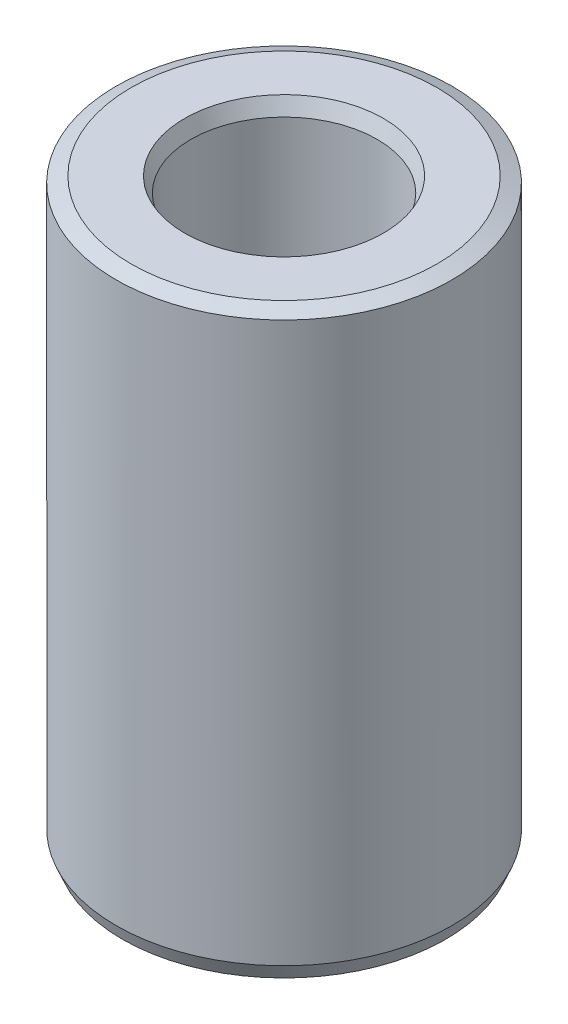
ISO-10303-21;
HEADER;
FILE_DESCRIPTION(('STEP AP214'),'2;1');
FILE_NAME('part.step','',(''),(''),'','','');
FILE_SCHEMA(('AUTOMOTIVE_DESIGN { 1 0 10303 214 1 1 1 1 }'));
ENDSEC;
DATA;
#1=APPLICATION_CONTEXT('core data for automotive mechanical design processes');
#2=APPLICATION_PROTOCOL_DEFINITION('international standard','automotive_design',2000,#1);
#3=PRODUCT_CONTEXT('',#1,'mechanical');
#4=PRODUCT('Part','Part','',(#3));
#5=PRODUCT_RELATED_PRODUCT_CATEGORY('part','',(#4));
#6=PRODUCT_DEFINITION_FORMATION('','',#4);
#7=PRODUCT_DEFINITION_CONTEXT('part definition',#1,'design');
#8=PRODUCT_DEFINITION('design','',#6,#7);
#9=PRODUCT_DEFINITION_SHAPE('','',#8);
#10=(LENGTH_UNIT() NAMED_UNIT(*) SI_UNIT(.MILLI.,.METRE.));
#11=(NAMED_UNIT(*) PLANE_ANGLE_UNIT() SI_UNIT($,.RADIAN.));
#12=(NAMED_UNIT(*) SI_UNIT($,.STERADIAN.) SOLID_ANGLE_UNIT());
#13=UNCERTAINTY_MEASURE_WITH_UNIT(LENGTH_MEASURE(1.E-05),#10,'distance_accuracy_value','');
#14=(GEOMETRIC_REPRESENTATION_CONTEXT(3) GLOBAL_UNCERTAINTY_ASSIGNED_CONTEXT((#13)) GLOBAL_UNIT_ASSIGNED_CONTEXT((#10,
#11,#12)) REPRESENTATION_CONTEXT('',''));
#15=CARTESIAN_POINT('',(0.,0.,0.));
#16=DIRECTION('',(0.,0.,1.));
#17=DIRECTION('',(1.,0.,0.));
#18=AXIS2_PLACEMENT_3D('',#15,#16,#17);
#19=CARTESIAN_POINT('',(0.,181.538281367582,0.));
#20=DIRECTION('',(0.,-1.,0.));
#21=DIRECTION('',(0.,0.,-1.));
#22=AXIS2_PLACEMENT_3D('',#19,#20,#21);
#23=CYLINDRICAL_SURFACE('',#22,52.5);
#24=CARTESIAN_POINT('',(0.,4.69443554910651,0.));
#25=DIRECTION('',(0.,1.,0.));
#26=DIRECTION('',(0.,0.,1.));
#27=AXIS2_PLACEMENT_3D('',#24,#25,#26);
#28=CIRCLE('',#27,52.5);
#29=CARTESIAN_POINT('',(0.,4.69443554910648,-52.5));
#30=VERTEX_POINT('',#29);
#31=EDGE_CURVE('E10',#30,#30,#28,.T.);
#32=CARTESIAN_POINT('',(0.,179.58006216952,0.));
#33=DIRECTION('',(0.,1.,0.));
#34=DIRECTION('',(0.,0.,1.));
#35=AXIS2_PLACEMENT_3D('',#32,#33,#34);
#36=CIRCLE('',#35,52.5);
#37=CARTESIAN_POINT('',(0.,179.58006216952,-52.5));
#38=VERTEX_POINT('',#37);
#39=EDGE_CURVE('E50',#38,#38,#36,.F.);
#40=CARTESIAN_POINT('',(0.,4.69443554910648,-52.5));
#41=CARTESIAN_POINT('',(0.,6.51616082640246,-52.5));
#42=CARTESIAN_POINT('',(0.,8.33788610369844,-52.5));
#43=CARTESIAN_POINT('',(0.,11.9813366582904,-52.5));
#44=CARTESIAN_POINT('',(0.,13.8030619355864,-52.5));
#45=CARTESIAN_POINT('',(0.,17.4465124901783,-52.5));
#46=CARTESIAN_POINT('',(0.,19.2682377674743,-52.5));
#47=CARTESIAN_POINT('',(0.,22.9116883220662,-52.5));
#48=CARTESIAN_POINT('',(0.,24.7334135993622,-52.5));
#49=CARTESIAN_POINT('',(0.,28.3768641539542,-52.5));
#50=CARTESIAN_POINT('',(0.,30.1985894312501,-52.5));
#51=CARTESIAN_POINT('',(0.,33.8420399858421,-52.5));
#52=CARTESIAN_POINT('',(0.,35.6637652631381,-52.5));
#53=CARTESIAN_POINT('',(0.,39.30721581773,-52.5));
#54=CARTESIAN_POINT('',(0.,41.128941095026,-52.5));
#55=CARTESIAN_POINT('',(0.,44.772391649618,-52.5));
#56=CARTESIAN_POINT('',(0.,46.5941169269139,-52.5));
#57=CARTESIAN_POINT('',(0.,50.2375674815059,-52.5));
#58=CARTESIAN_POINT('',(0.,52.0592927588019,-52.5));
#59=CARTESIAN_POINT('',(0.,55.7027433133938,-52.5));
#60=CARTESIAN_POINT('',(0.,57.5244685906898,-52.5));
#61=CARTESIAN_POINT('',(0.,61.1679191452817,-52.5));
#62=CARTESIAN_POINT('',(0.,62.9896444225777,-52.5));
#63=CARTESIAN_POINT('',(0.,66.6330949771696,-52.5));
#64=CARTESIAN_POINT('',(0.,68.4548202544656,-52.5));
#65=CARTESIAN_POINT('',(0.,72.0982708090576,-52.5));
#66=CARTESIAN_POINT('',(0.,73.9199960863535,-52.5));
#67=CARTESIAN_POINT('',(0.,77.5634466409455,-52.5));
#68=CARTESIAN_POINT('',(0.,79.3851719182415,-52.5));
#69=CARTESIAN_POINT('',(0.,83.0286224728334,-52.5));
#70=CARTESIAN_POINT('',(0.,84.8503477501294,-52.5));
#71=CARTESIAN_POINT('',(0.,88.4937983047214,-52.5));
#72=CARTESIAN_POINT('',(0.,90.3155235820173,-52.5));
#73=CARTESIAN_POINT('',(0.,93.9589741366093,-52.5));
#74=CARTESIAN_POINT('',(0.,95.7806994139053,-52.5));
#75=CARTESIAN_POINT('',(0.,99.4241499684972,-52.5));
#76=CARTESIAN_POINT('',(0.,101.245875245793,-52.5));
#77=CARTESIAN_POINT('',(0.,104.889325800385,-52.5));
#78=CARTESIAN_POINT('',(0.,106.711051077681,-52.5));
#79=CARTESIAN_POINT('',(0.,110.354501632273,-52.5));
#80=CARTESIAN_POINT('',(0.,112.176226909569,-52.5));
#81=CARTESIAN_POINT('',(0.,115.819677464161,-52.5));
#82=CARTESIAN_POINT('',(0.,117.641402741457,-52.5));
#83=CARTESIAN_POINT('',(0.,121.284853296049,-52.5));
#84=CARTESIAN_POINT('',(0.,123.106578573345,-52.5));
#85=CARTESIAN_POINT('',(0.,126.750029127937,-52.5));
#86=CARTESIAN_POINT('',(0.,128.571754405233,-52.5));
#87=CARTESIAN_POINT('',(0.,132.215204959825,-52.5));
#88=CARTESIAN_POINT('',(0.,134.036930237121,-52.5));
#89=CARTESIAN_POINT('',(0.,137.680380791713,-52.5));
#90=CARTESIAN_POINT('',(0.,139.502106069009,-52.5));
#91=CARTESIAN_POINT('',(0.,143.145556623601,-52.5));
#92=CARTESIAN_POINT('',(0.,144.967281900897,-52.5));
#93=CARTESIAN_POINT('',(0.,148.610732455489,-52.5));
#94=CARTESIAN_POINT('',(0.,150.432457732785,-52.5));
#95=CARTESIAN_POINT('',(0.,154.075908287376,-52.5));
#96=CARTESIAN_POINT('',(0.,155.897633564672,-52.5));
#97=CARTESIAN_POINT('',(0.,159.541084119264,-52.5));
#98=CARTESIAN_POINT('',(0.,161.36280939656,-52.5));
#99=CARTESIAN_POINT('',(0.,165.006259951152,-52.5));
#100=CARTESIAN_POINT('',(0.,166.827985228448,-52.5));
#101=CARTESIAN_POINT('',(0.,170.47143578304,-52.5));
#102=CARTESIAN_POINT('',(0.,172.293161060336,-52.5));
#103=CARTESIAN_POINT('',(0.,175.936611614928,-52.5));
#104=CARTESIAN_POINT('',(0.,177.758336892224,-52.5));
#105=CARTESIAN_POINT('',(0.,179.58006216952,-52.5));
#106=B_SPLINE_CURVE_WITH_KNOTS('',3,(#40,#41,#42,#43,#44,#45,#46,#47,#48,#49,#50,#51,#52,#53,
#54,#55,#56,#57,#58,#59,#60,#61,#62,#63,#64,#65,#66,#67,#68,#69,#70,#71,#72,#73,#74,#75,#76,#77,
#78,#79,#80,#81,#82,#83,#84,#85,#86,#87,#88,#89,#90,#91,#92,#93,#94,#95,#96,#97,#98,#99,#100,
#101,#102,#103,#104,#105),.UNSPECIFIED.,.F.,.F.,(4,2,2,2,2,2,2,2,2,2,2,2,2,2,2,2,2,2,2,2,2,2,2,
2,2,2,2,2,2,2,2,2,4),(0.,5.46517583188794,10.9303516637758,16.3955274956638,21.8607033275517,
27.3258791594396,32.7910549913276,38.2562308232155,43.7214066551034,49.1865824869913,
54.6517583188793,60.1169341507672,65.5821099826551,71.047285814543,76.512461646431,
81.9776374783189,87.4428133102068,92.9079891420947,98.3731649739827,103.838340805871,
109.303516637759,114.768692469646,120.233868301534,125.699044133422,131.16421996531,
136.629395797198,142.094571629086,147.559747460974,153.024923292862,158.49009912475,
163.955274956638,169.420450788526,174.885626620414),.UNSPECIFIED.);
#107=EDGE_CURVE('BSEAM39',#30,#38,#106,.T.);
#108=ORIENTED_EDGE('',*,*,#31,.T.);
#109=ORIENTED_EDGE('',*,*,#39,.T.);
#110=ORIENTED_EDGE('',*,*,#107,.T.);
#111=ORIENTED_EDGE('',*,*,#107,.F.);
#112=EDGE_LOOP('',(#108,#110,#109,#111));
#113=FACE_BOUND('',#112,.T.);
#114=ADVANCED_FACE('F39',(#113),#23,.T.);
#115=CARTESIAN_POINT('',(0.,181.538281367582,0.));
#116=DIRECTION('',(0.,1.,0.));
#117=DIRECTION('',(0.,0.,1.));
#118=AXIS2_PLACEMENT_3D('',#115,#116,#117);
#119=PLANE('',#118);
#120=CARTESIAN_POINT('',(0.,181.538281367582,0.));
#121=DIRECTION('',(0.,1.,0.));
#122=DIRECTION('',(0.,0.,1.));
#123=AXIS2_PLACEMENT_3D('',#120,#121,#122);
#124=CIRCLE('',#123,31.0921849153804);
#125=CARTESIAN_POINT('',(0.,181.538281367582,31.0921849153804));
#126=VERTEX_POINT('',#125);
#127=EDGE_CURVE('E58',#126,#126,#124,.F.);
#128=ORIENTED_EDGE('',*,*,#127,.T.);
#129=EDGE_LOOP('',(#128));
#130=FACE_BOUND('',#129,.T.);
#131=CARTESIAN_POINT('',(0.,181.538281367582,0.));
#132=DIRECTION('',(0.,1.,0.));
#133=DIRECTION('',(0.,0.,1.));
#134=AXIS2_PLACEMENT_3D('',#131,#132,#133);
#135=CIRCLE('',#134,47.8055644508945);
#136=CARTESIAN_POINT('',(0.,181.538281367582,47.8055644508945));
#137=VERTEX_POINT('',#136);
#138=EDGE_CURVE('E61',#137,#137,#135,.T.);
#139=ORIENTED_EDGE('',*,*,#138,.T.);
#140=EDGE_LOOP('',(#139));
#141=FACE_BOUND('',#140,.T.);
#142=ADVANCED_FACE('F88',(#130,#141),#119,.T.);
#143=CARTESIAN_POINT('',(0.,0.,0.));
#144=DIRECTION('',(0.,1.,0.));
#145=DIRECTION('',(0.,0.,1.));
#146=AXIS2_PLACEMENT_3D('',#143,#144,#145);
#147=PLANE('',#146);
#148=CARTESIAN_POINT('',(0.,0.,0.));
#149=DIRECTION('',(0.,1.,0.));
#150=DIRECTION('',(0.,0.,1.));
#151=AXIS2_PLACEMENT_3D('',#148,#149,#150);
#152=CIRCLE('',#151,33.8284012664237);
#153=CARTESIAN_POINT('',(0.,0.,33.8284012664237));
#154=VERTEX_POINT('',#153);
#155=EDGE_CURVE('E51',#154,#154,#152,.T.);
#156=ORIENTED_EDGE('',*,*,#155,.T.);
#157=EDGE_LOOP('',(#156));
#158=FACE_BOUND('',#157,.T.);
#159=CARTESIAN_POINT('',(0.,0.,0.));
#160=DIRECTION('',(0.,1.,0.));
#161=DIRECTION('',(0.,0.,1.));
#162=AXIS2_PLACEMENT_3D('',#159,#160,#161);
#163=CIRCLE('',#162,50.5417808019375);
#164=CARTESIAN_POINT('',(0.,0.,50.5417808019375));
#165=VERTEX_POINT('',#164);
#166=EDGE_CURVE('E54',#165,#165,#163,.F.);
#167=ORIENTED_EDGE('',*,*,#166,.T.);
#168=EDGE_LOOP('',(#167));
#169=FACE_BOUND('',#168,.T.);
#170=ADVANCED_FACE('F83',(#158,#169),#147,.F.);
#171=CARTESIAN_POINT('',(0.,181.538281367582,0.));
#172=DIRECTION('',(0.,-1.,0.));
#173=DIRECTION('',(0.,0.,-1.));
#174=AXIS2_PLACEMENT_3D('',#171,#172,#173);
#175=CYLINDRICAL_SURFACE('',#174,29.1339657173181);
#176=CARTESIAN_POINT('',(0.,176.843845818476,0.));
#177=DIRECTION('',(0.,1.,0.));
#178=DIRECTION('',(0.,0.,1.));
#179=AXIS2_PLACEMENT_3D('',#176,#177,#178);
#180=CIRCLE('',#179,29.1339657173181);
#181=CARTESIAN_POINT('',(0.,176.843845818476,-29.1339657173181));
#182=VERTEX_POINT('',#181);
#183=EDGE_CURVE('E67',#182,#182,#180,.T.);
#184=CARTESIAN_POINT('',(0.,1.95821919806208,0.));
#185=DIRECTION('',(0.,1.,0.));
#186=DIRECTION('',(0.,0.,1.));
#187=AXIS2_PLACEMENT_3D('',#184,#185,#186);
#188=CIRCLE('',#187,29.1339657173181);
#189=CARTESIAN_POINT('',(0.,1.95821919806205,-29.1339657173181));
#190=VERTEX_POINT('',#189);
#191=EDGE_CURVE('E69',#190,#190,#188,.F.);
#192=CARTESIAN_POINT('',(0.,176.843845818476,-29.1339657173181));
#193=CARTESIAN_POINT('',(0.,175.02212054118,-29.1339657173181));
#194=CARTESIAN_POINT('',(0.,173.200395263884,-29.1339657173181));
#195=CARTESIAN_POINT('',(0.,169.556944709292,-29.1339657173181));
#196=CARTESIAN_POINT('',(0.,167.735219431996,-29.1339657173181));
#197=CARTESIAN_POINT('',(0.,164.091768877404,-29.1339657173181));
#198=CARTESIAN_POINT('',(0.,162.270043600108,-29.1339657173181));
#199=CARTESIAN_POINT('',(0.,158.626593045516,-29.1339657173181));
#200=CARTESIAN_POINT('',(0.,156.80486776822,-29.1339657173181));
#201=CARTESIAN_POINT('',(0.,153.161417213628,-29.1339657173181));
#202=CARTESIAN_POINT('',(0.,151.339691936332,-29.1339657173181));
#203=CARTESIAN_POINT('',(0.,147.69624138174,-29.1339657173181));
#204=CARTESIAN_POINT('',(0.,145.874516104444,-29.1339657173181));
#205=CARTESIAN_POINT('',(0.,142.231065549852,-29.1339657173181));
#206=CARTESIAN_POINT('',(0.,140.409340272556,-29.1339657173181));
#207=CARTESIAN_POINT('',(0.,136.765889717964,-29.1339657173181));
#208=CARTESIAN_POINT('',(0.,134.944164440669,-29.1339657173181));
#209=CARTESIAN_POINT('',(0.,131.300713886077,-29.1339657173181));
#210=CARTESIAN_POINT('',(0.,129.478988608781,-29.1339657173181));
#211=CARTESIAN_POINT('',(0.,125.835538054189,-29.1339657173181));
#212=CARTESIAN_POINT('',(0.,124.013812776893,-29.1339657173181));
#213=CARTESIAN_POINT('',(0.,120.370362222301,-29.1339657173181));
#214=CARTESIAN_POINT('',(0.,118.548636945005,-29.1339657173181));
#215=CARTESIAN_POINT('',(0.,114.905186390413,-29.1339657173181));
#216=CARTESIAN_POINT('',(0.,113.083461113117,-29.1339657173181));
#217=CARTESIAN_POINT('',(0.,109.440010558525,-29.1339657173181));
#218=CARTESIAN_POINT('',(0.,107.618285281229,-29.1339657173181));
#219=CARTESIAN_POINT('',(0.,103.974834726637,-29.1339657173181));
#220=CARTESIAN_POINT('',(0.,102.153109449341,-29.1339657173181));
#221=CARTESIAN_POINT('',(0.,98.5096588947489,-29.1339657173181));
#222=CARTESIAN_POINT('',(0.,96.6879336174529,-29.1339657173181));
#223=CARTESIAN_POINT('',(0.,93.044483062861,-29.1339657173181));
#224=CARTESIAN_POINT('',(0.,91.222757785565,-29.1339657173181));
#225=CARTESIAN_POINT('',(0.,87.5793072309731,-29.1339657173181));
#226=CARTESIAN_POINT('',(0.,85.7575819536771,-29.1339657173181));
#227=CARTESIAN_POINT('',(0.,82.1141313990851,-29.1339657173181));
#228=CARTESIAN_POINT('',(0.,80.2924061217891,-29.1339657173181));
#229=CARTESIAN_POINT('',(0.,76.6489555671972,-29.1339657173181));
#230=CARTESIAN_POINT('',(0.,74.8272302899012,-29.1339657173181));
#231=CARTESIAN_POINT('',(0.,71.1837797353092,-29.1339657173181));
#232=CARTESIAN_POINT('',(0.,69.3620544580133,-29.1339657173181));
#233=CARTESIAN_POINT('',(0.,65.7186039034213,-29.1339657173181));
#234=CARTESIAN_POINT('',(0.,63.8968786261253,-29.1339657173181));
#235=CARTESIAN_POINT('',(0.,60.2534280715334,-29.1339657173181));
#236=CARTESIAN_POINT('',(0.,58.4317027942374,-29.1339657173181));
#237=CARTESIAN_POINT('',(0.,54.7882522396454,-29.1339657173181));
#238=CARTESIAN_POINT('',(0.,52.9665269623495,-29.1339657173181));
#239=CARTESIAN_POINT('',(0.,49.3230764077575,-29.1339657173181));
#240=CARTESIAN_POINT('',(0.,47.5013511304615,-29.1339657173181));
#241=CARTESIAN_POINT('',(0.,43.8579005758696,-29.1339657173181));
#242=CARTESIAN_POINT('',(0.,42.0361752985736,-29.1339657173181));
#243=CARTESIAN_POINT('',(0.,38.3927247439816,-29.1339657173181));
#244=CARTESIAN_POINT('',(0.,36.5709994666856,-29.1339657173181));
#245=CARTESIAN_POINT('',(0.,32.9275489120937,-29.1339657173181));
#246=CARTESIAN_POINT('',(0.,31.1058236347977,-29.1339657173181));
#247=CARTESIAN_POINT('',(0.,27.4623730802058,-29.1339657173181));
#248=CARTESIAN_POINT('',(0.,25.6406478029098,-29.1339657173181));
#249=CARTESIAN_POINT('',(0.,21.9971972483178,-29.1339657173181));
#250=CARTESIAN_POINT('',(0.,20.1754719710218,-29.1339657173181));
#251=CARTESIAN_POINT('',(0.,16.5320214164299,-29.1339657173181));
#252=CARTESIAN_POINT('',(0.,14.7102961391339,-29.1339657173181));
#253=CARTESIAN_POINT('',(0.,11.0668455845419,-29.1339657173181));
#254=CARTESIAN_POINT('',(0.,9.24512030724596,-29.1339657173181));
#255=CARTESIAN_POINT('',(0.,5.60166975265401,-29.1339657173181));
#256=CARTESIAN_POINT('',(0.,3.77994447535803,-29.1339657173181));
#257=CARTESIAN_POINT('',(0.,1.95821919806205,-29.1339657173181));
#258=B_SPLINE_CURVE_WITH_KNOTS('',3,(#192,#193,#194,#195,#196,#197,#198,#199,#200,#201,#202,
#203,#204,#205,#206,#207,#208,#209,#210,#211,#212,#213,#214,#215,#216,#217,#218,#219,#220,#221,
#222,#223,#224,#225,#226,#227,#228,#229,#230,#231,#232,#233,#234,#235,#236,#237,#238,#239,#240,
#241,#242,#243,#244,#245,#246,#247,#248,#249,#250,#251,#252,#253,#254,#255,#256,#257),
.UNSPECIFIED.,.F.,.F.,(4,2,2,2,2,2,2,2,2,2,2,2,2,2,2,2,2,2,2,2,2,2,2,2,2,2,2,2,2,2,2,2,4),(0.,
5.46517583188791,10.9303516637758,16.3955274956638,21.8607033275517,27.3258791594397,
32.7910549913276,38.2562308232155,43.7214066551035,49.1865824869914,54.6517583188793,
60.1169341507673,65.5821099826552,71.0472858145431,76.5124616464311,81.977637478319,
87.442813310207,92.9079891420949,98.3731649739828,103.838340805871,109.303516637759,
114.768692469647,120.233868301535,125.699044133423,131.16421996531,136.629395797198,
142.094571629086,147.559747460974,153.024923292862,158.49009912475,163.955274956638,
169.420450788526,174.885626620414),.UNSPECIFIED.);
#259=EDGE_CURVE('BSEAM71',#182,#190,#258,.T.);
#260=ORIENTED_EDGE('',*,*,#183,.T.);
#261=ORIENTED_EDGE('',*,*,#191,.T.);
#262=ORIENTED_EDGE('',*,*,#259,.T.);
#263=ORIENTED_EDGE('',*,*,#259,.F.);
#264=EDGE_LOOP('',(#260,#262,#261,#263));
#265=FACE_BOUND('',#264,.T.);
#266=ADVANCED_FACE('F71',(#265),#175,.F.);
#267=CARTESIAN_POINT('',(0.,176.843845818476,0.));
#268=DIRECTION('',(0.,1.,0.));
#269=DIRECTION('',(0.,0.,1.));
#270=AXIS2_PLACEMENT_3D('',#267,#268,#269);
#271=CONICAL_SURFACE('',#270,29.1339657173181,0.395191163568246);
#272=ORIENTED_EDGE('',*,*,#127,.F.);
#273=EDGE_LOOP('',(#272));
#274=FACE_BOUND('',#273,.T.);
#275=ORIENTED_EDGE('',*,*,#183,.F.);
#276=EDGE_LOOP('',(#275));
#277=FACE_BOUND('',#276,.T.);
#278=ADVANCED_FACE('F77',(#274,#277),#271,.F.);
#279=CARTESIAN_POINT('',(0.,0.,0.));
#280=DIRECTION('',(0.,-1.,0.));
#281=DIRECTION('',(0.,0.,-1.));
#282=AXIS2_PLACEMENT_3D('',#279,#280,#281);
#283=CONICAL_SURFACE('',#282,33.8284012664237,1.17560516322665);
#284=ORIENTED_EDGE('',*,*,#191,.F.);
#285=EDGE_LOOP('',(#284));
#286=FACE_BOUND('',#285,.T.);
#287=ORIENTED_EDGE('',*,*,#155,.F.);
#288=EDGE_LOOP('',(#287));
#289=FACE_BOUND('',#288,.T.);
#290=ADVANCED_FACE('F73',(#286,#289),#283,.F.);
#291=CARTESIAN_POINT('',(0.,4.69443554910651,0.));
#292=DIRECTION('',(0.,1.,0.));
#293=DIRECTION('',(0.,0.,1.));
#294=AXIS2_PLACEMENT_3D('',#291,#292,#293);
#295=CONICAL_SURFACE('',#294,52.5,0.395191163568252);
#296=ORIENTED_EDGE('',*,*,#166,.F.);
#297=EDGE_LOOP('',(#296));
#298=FACE_BOUND('',#297,.T.);
#299=ORIENTED_EDGE('',*,*,#31,.F.);
#300=EDGE_LOOP('',(#299));
#301=FACE_BOUND('',#300,.T.);
#302=ADVANCED_FACE('F76',(#298,#301),#295,.T.);
#303=CARTESIAN_POINT('',(0.,181.538281367582,0.));
#304=DIRECTION('',(0.,-1.,0.));
#305=DIRECTION('',(0.,0.,-1.));
#306=AXIS2_PLACEMENT_3D('',#303,#304,#305);
#307=CONICAL_SURFACE('',#306,47.8055644508945,1.17560516322664);
#308=ORIENTED_EDGE('',*,*,#39,.F.);
#309=EDGE_LOOP('',(#308));
#310=FACE_BOUND('',#309,.T.);
#311=ORIENTED_EDGE('',*,*,#138,.F.);
#312=EDGE_LOOP('',(#311));
#313=FACE_BOUND('',#312,.T.);
#314=ADVANCED_FACE('F45',(#310,#313),#307,.T.);
#315=CLOSED_SHELL('',(#114,#142,#170,#266,#278,#290,#302,#314));
#316=MANIFOLD_SOLID_BREP('B2',#315);
#317=ADVANCED_BREP_SHAPE_REPRESENTATION('',(#18,#316),#14);
#318=SHAPE_DEFINITION_REPRESENTATION(#9,#317);
ENDSEC;
END-ISO-10303-21;
